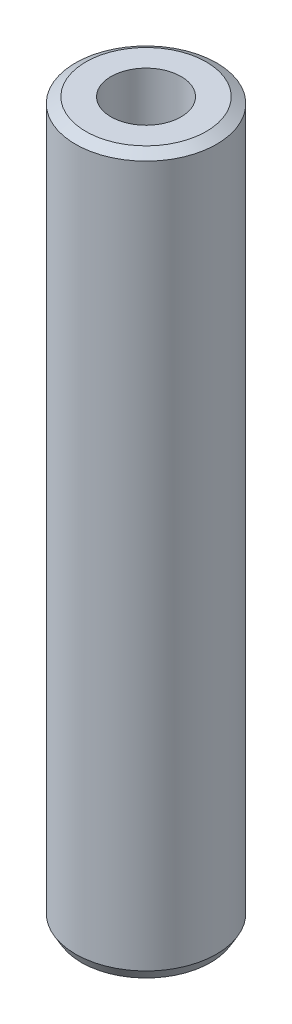
ISO-10303-21;
HEADER;
FILE_DESCRIPTION(('STEP AP214'),'2;1');
FILE_NAME('part.step','',(''),(''),'','','');
FILE_SCHEMA(('AUTOMOTIVE_DESIGN { 1 0 10303 214 1 1 1 1 }'));
ENDSEC;
DATA;
#1=APPLICATION_CONTEXT('core data for automotive mechanical design processes');
#2=APPLICATION_PROTOCOL_DEFINITION('international standard','automotive_design',2000,#1);
#3=PRODUCT_CONTEXT('',#1,'mechanical');
#4=PRODUCT('Part','Part','',(#3));
#5=PRODUCT_RELATED_PRODUCT_CATEGORY('part','',(#4));
#6=PRODUCT_DEFINITION_FORMATION('','',#4);
#7=PRODUCT_DEFINITION_CONTEXT('part definition',#1,'design');
#8=PRODUCT_DEFINITION('design','',#6,#7);
#9=PRODUCT_DEFINITION_SHAPE('','',#8);
#10=(LENGTH_UNIT() NAMED_UNIT(*) SI_UNIT(.MILLI.,.METRE.));
#11=(NAMED_UNIT(*) PLANE_ANGLE_UNIT() SI_UNIT($,.RADIAN.));
#12=(NAMED_UNIT(*) SI_UNIT($,.STERADIAN.) SOLID_ANGLE_UNIT());
#13=UNCERTAINTY_MEASURE_WITH_UNIT(LENGTH_MEASURE(1.E-05),#10,'distance_accuracy_value','');
#14=(GEOMETRIC_REPRESENTATION_CONTEXT(3) GLOBAL_UNCERTAINTY_ASSIGNED_CONTEXT((#13)) GLOBAL_UNIT_ASSIGNED_CONTEXT((#10,
#11,#12)) REPRESENTATION_CONTEXT('',''));
#15=CARTESIAN_POINT('',(0.,0.,0.));
#16=DIRECTION('',(0.,0.,1.));
#17=DIRECTION('',(1.,0.,0.));
#18=AXIS2_PLACEMENT_3D('',#15,#16,#17);
#19=CARTESIAN_POINT('',(0.,355.89672085268,0.));
#20=DIRECTION('',(0.,-1.,0.));
#21=DIRECTION('',(0.,0.,-1.));
#22=AXIS2_PLACEMENT_3D('',#19,#20,#21);
#23=CYLINDRICAL_SURFACE('',#22,35.);
#24=CARTESIAN_POINT('',(0.,352.944748443648,0.));
#25=DIRECTION('',(0.,1.,0.));
#26=DIRECTION('',(0.,0.,1.));
#27=AXIS2_PLACEMENT_3D('',#24,#25,#26);
#28=CIRCLE('',#27,35.);
#29=CARTESIAN_POINT('',(0.,352.944748443648,-35.));
#30=VERTEX_POINT('',#29);
#31=EDGE_CURVE('E50',#30,#30,#28,.F.);
#32=CARTESIAN_POINT('',(0.,5.11296619498541,0.));
#33=DIRECTION('',(0.,1.,0.));
#34=DIRECTION('',(0.,0.,1.));
#35=AXIS2_PLACEMENT_3D('',#32,#33,#34);
#36=CIRCLE('',#35,35.);
#37=CARTESIAN_POINT('',(0.,5.11296619498541,-35.));
#38=VERTEX_POINT('',#37);
#39=EDGE_CURVE('E51',#38,#38,#36,.T.);
#40=CARTESIAN_POINT('',(0.,352.944748443648,-35.));
#41=CARTESIAN_POINT('',(0.,349.321500711891,-35.));
#42=CARTESIAN_POINT('',(0.,345.698252980135,-35.));
#43=CARTESIAN_POINT('',(0.,338.451757516621,-35.));
#44=CARTESIAN_POINT('',(0.,334.828509784864,-35.));
#45=CARTESIAN_POINT('',(0.,327.58201432135,-35.));
#46=CARTESIAN_POINT('',(0.,323.958766589593,-35.));
#47=CARTESIAN_POINT('',(0.,316.712271126079,-35.));
#48=CARTESIAN_POINT('',(0.,313.089023394322,-35.));
#49=CARTESIAN_POINT('',(0.,305.842527930809,-35.));
#50=CARTESIAN_POINT('',(0.,302.219280199052,-35.));
#51=CARTESIAN_POINT('',(0.,294.972784735538,-35.));
#52=CARTESIAN_POINT('',(0.,291.349537003781,-35.));
#53=CARTESIAN_POINT('',(0.,284.103041540267,-35.));
#54=CARTESIAN_POINT('',(0.,280.47979380851,-35.));
#55=CARTESIAN_POINT('',(0.,273.233298344997,-35.));
#56=CARTESIAN_POINT('',(0.,269.61005061324,-35.));
#57=CARTESIAN_POINT('',(0.,262.363555149726,-35.));
#58=CARTESIAN_POINT('',(0.,258.740307417969,-35.));
#59=CARTESIAN_POINT('',(0.,251.493811954455,-35.));
#60=CARTESIAN_POINT('',(0.,247.870564222698,-35.));
#61=CARTESIAN_POINT('',(0.,240.624068759184,-35.));
#62=CARTESIAN_POINT('',(0.,237.000821027427,-35.));
#63=CARTESIAN_POINT('',(0.,229.754325563914,-35.));
#64=CARTESIAN_POINT('',(0.,226.131077832157,-35.));
#65=CARTESIAN_POINT('',(0.,218.884582368643,-35.));
#66=CARTESIAN_POINT('',(0.,215.261334636886,-35.));
#67=CARTESIAN_POINT('',(0.,208.014839173372,-35.));
#68=CARTESIAN_POINT('',(0.,204.391591441615,-35.));
#69=CARTESIAN_POINT('',(0.,197.145095978101,-35.));
#70=CARTESIAN_POINT('',(0.,193.521848246345,-35.));
#71=CARTESIAN_POINT('',(0.,186.275352782831,-35.));
#72=CARTESIAN_POINT('',(0.,182.652105051074,-35.));
#73=CARTESIAN_POINT('',(0.,175.40560958756,-35.));
#74=CARTESIAN_POINT('',(0.,171.782361855803,-35.));
#75=CARTESIAN_POINT('',(0.,164.535866392289,-35.));
#76=CARTESIAN_POINT('',(0.,160.912618660532,-35.));
#77=CARTESIAN_POINT('',(0.,153.666123197019,-35.));
#78=CARTESIAN_POINT('',(0.,150.042875465262,-35.));
#79=CARTESIAN_POINT('',(0.,142.796380001748,-35.));
#80=CARTESIAN_POINT('',(0.,139.173132269991,-35.));
#81=CARTESIAN_POINT('',(0.,131.926636806477,-35.));
#82=CARTESIAN_POINT('',(0.,128.30338907472,-35.));
#83=CARTESIAN_POINT('',(0.,121.056893611206,-35.));
#84=CARTESIAN_POINT('',(0.,117.43364587945,-35.));
#85=CARTESIAN_POINT('',(0.,110.187150415936,-35.));
#86=CARTESIAN_POINT('',(0.,106.563902684179,-35.));
#87=CARTESIAN_POINT('',(0.,99.317407220665,-35.));
#88=CARTESIAN_POINT('',(0.,95.6941594889081,-35.));
#89=CARTESIAN_POINT('',(0.,88.4476640253942,-35.));
#90=CARTESIAN_POINT('',(0.,84.8244162936373,-35.));
#91=CARTESIAN_POINT('',(0.,77.5779208301235,-35.));
#92=CARTESIAN_POINT('',(0.,73.9546730983666,-35.));
#93=CARTESIAN_POINT('',(0.,66.7081776348528,-35.));
#94=CARTESIAN_POINT('',(0.,63.0849299030959,-35.));
#95=CARTESIAN_POINT('',(0.,55.8384344395821,-35.));
#96=CARTESIAN_POINT('',(0.,52.2151867078252,-35.));
#97=CARTESIAN_POINT('',(0.,44.9686912443114,-35.));
#98=CARTESIAN_POINT('',(0.,41.3454435125545,-35.));
#99=CARTESIAN_POINT('',(0.,34.0989480490407,-35.));
#100=CARTESIAN_POINT('',(0.,30.4757003172838,-35.));
#101=CARTESIAN_POINT('',(0.,23.22920485377,-35.));
#102=CARTESIAN_POINT('',(0.,19.6059571220131,-35.));
#103=CARTESIAN_POINT('',(0.,12.3594616584992,-35.));
#104=CARTESIAN_POINT('',(0.,8.73621392674232,-35.));
#105=CARTESIAN_POINT('',(0.,5.11296619498541,-35.));
#106=B_SPLINE_CURVE_WITH_KNOTS('',3,(#40,#41,#42,#43,#44,#45,#46,#47,#48,#49,#50,#51,#52,#53,
#54,#55,#56,#57,#58,#59,#60,#61,#62,#63,#64,#65,#66,#67,#68,#69,#70,#71,#72,#73,#74,#75,#76,#77,
#78,#79,#80,#81,#82,#83,#84,#85,#86,#87,#88,#89,#90,#91,#92,#93,#94,#95,#96,#97,#98,#99,#100,
#101,#102,#103,#104,#105),.UNSPECIFIED.,.F.,.F.,(4,2,2,2,2,2,2,2,2,2,2,2,2,2,2,2,2,2,2,2,2,2,2,
2,2,2,2,2,2,2,2,2,4),(0.,10.8697431952707,21.7394863905414,32.6092295858121,43.4789727810829,
54.3487159763535,65.2184591716243,76.088202366895,86.9579455621657,97.8276887574364,
108.697431952707,119.567175147978,130.436918343249,141.306661538519,152.17640473379,
163.046147929061,173.915891124331,184.785634319602,195.655377514873,206.525120710144,
217.394863905414,228.264607100685,239.134350295956,250.004093491226,260.873836686497,
271.743579881768,282.613323077039,293.483066272309,304.35280946758,315.222552662851,
326.092295858121,336.962039053392,347.831782248663),.UNSPECIFIED.);
#107=EDGE_CURVE('BSEAM39',#30,#38,#106,.T.);
#108=ORIENTED_EDGE('',*,*,#31,.T.);
#109=ORIENTED_EDGE('',*,*,#39,.T.);
#110=ORIENTED_EDGE('',*,*,#107,.T.);
#111=ORIENTED_EDGE('',*,*,#107,.F.);
#112=EDGE_LOOP('',(#108,#110,#109,#111));
#113=FACE_BOUND('',#112,.T.);
#114=ADVANCED_FACE('F39',(#113),#23,.T.);
#115=CARTESIAN_POINT('',(0.,355.89672085268,0.));
#116=DIRECTION('',(0.,1.,0.));
#117=DIRECTION('',(0.,0.,1.));
#118=AXIS2_PLACEMENT_3D('',#115,#116,#117);
#119=PLANE('',#118);
#120=CARTESIAN_POINT('',(0.,355.89672085268,0.));
#121=DIRECTION('',(0.,1.,0.));
#122=DIRECTION('',(0.,0.,1.));
#123=AXIS2_PLACEMENT_3D('',#120,#121,#122);
#124=CIRCLE('',#123,29.8870338050153);
#125=CARTESIAN_POINT('',(0.,355.89672085268,-29.8870338050153));
#126=VERTEX_POINT('',#125);
#127=EDGE_CURVE('E54',#126,#126,#124,.T.);
#128=ORIENTED_EDGE('',*,*,#127,.T.);
#129=EDGE_LOOP('',(#128));
#130=FACE_BOUND('',#129,.T.);
#131=CARTESIAN_POINT('',(0.,355.89672085268,0.));
#132=DIRECTION('',(0.,1.,0.));
#133=DIRECTION('',(0.,0.,1.));
#134=AXIS2_PLACEMENT_3D('',#131,#132,#133);
#135=CIRCLE('',#134,17.3707291224868);
#136=CARTESIAN_POINT('',(0.,355.89672085268,-17.3707291224868));
#137=VERTEX_POINT('',#136);
#138=EDGE_CURVE('E58',#137,#137,#135,.T.);
#139=ORIENTED_EDGE('',*,*,#138,.F.);
#140=EDGE_LOOP('',(#139));
#141=FACE_BOUND('',#140,.T.);
#142=ADVANCED_FACE('F69',(#130,#141),#119,.T.);
#143=CARTESIAN_POINT('',(0.,0.,0.));
#144=DIRECTION('',(0.,1.,0.));
#145=DIRECTION('',(0.,0.,1.));
#146=AXIS2_PLACEMENT_3D('',#143,#144,#145);
#147=PLANE('',#146);
#148=CARTESIAN_POINT('',(0.,0.,0.));
#149=DIRECTION('',(0.,1.,0.));
#150=DIRECTION('',(0.,0.,1.));
#151=AXIS2_PLACEMENT_3D('',#148,#149,#150);
#152=CIRCLE('',#151,32.0480275909677);
#153=CARTESIAN_POINT('',(0.,0.,32.0480275909677));
#154=VERTEX_POINT('',#153);
#155=EDGE_CURVE('E10',#154,#154,#152,.F.);
#156=ORIENTED_EDGE('',*,*,#155,.T.);
#157=EDGE_LOOP('',(#156));
#158=FACE_BOUND('',#157,.T.);
#159=CARTESIAN_POINT('',(0.,0.,0.));
#160=DIRECTION('',(0.,1.,0.));
#161=DIRECTION('',(0.,0.,1.));
#162=AXIS2_PLACEMENT_3D('',#159,#160,#161);
#163=CIRCLE('',#162,17.3707291224868);
#164=CARTESIAN_POINT('',(0.,0.,-17.3707291224868));
#165=VERTEX_POINT('',#164);
#166=EDGE_CURVE('E63',#165,#165,#163,.T.);
#167=ORIENTED_EDGE('',*,*,#166,.T.);
#168=EDGE_LOOP('',(#167));
#169=FACE_BOUND('',#168,.T.);
#170=ADVANCED_FACE('F75',(#158,#169),#147,.F.);
#171=CARTESIAN_POINT('',(0.,355.89672085268,0.));
#172=DIRECTION('',(0.,-1.,0.));
#173=DIRECTION('',(0.,0.,-1.));
#174=AXIS2_PLACEMENT_3D('',#171,#172,#173);
#175=CYLINDRICAL_SURFACE('',#174,17.3707291224868);
#176=CARTESIAN_POINT('',(0.,355.89672085268,-17.3707291224868));
#177=CARTESIAN_POINT('',(0.,352.189463343798,-17.3707291224868));
#178=CARTESIAN_POINT('',(0.,348.482205834916,-17.3707291224868));
#179=CARTESIAN_POINT('',(0.,341.067690817152,-17.3707291224868));
#180=CARTESIAN_POINT('',(0.,337.36043330827,-17.3707291224868));
#181=CARTESIAN_POINT('',(0.,329.945918290506,-17.3707291224868));
#182=CARTESIAN_POINT('',(0.,326.238660781624,-17.3707291224868));
#183=CARTESIAN_POINT('',(0.,318.824145763859,-17.3707291224868));
#184=CARTESIAN_POINT('',(0.,315.116888254977,-17.3707291224868));
#185=CARTESIAN_POINT('',(0.,307.702373237213,-17.3707291224868));
#186=CARTESIAN_POINT('',(0.,303.995115728331,-17.3707291224868));
#187=CARTESIAN_POINT('',(0.,296.580600710567,-17.3707291224868));
#188=CARTESIAN_POINT('',(0.,292.873343201685,-17.3707291224868));
#189=CARTESIAN_POINT('',(0.,285.458828183921,-17.3707291224868));
#190=CARTESIAN_POINT('',(0.,281.751570675039,-17.3707291224868));
#191=CARTESIAN_POINT('',(0.,274.337055657274,-17.3707291224868));
#192=CARTESIAN_POINT('',(0.,270.629798148392,-17.3707291224868));
#193=CARTESIAN_POINT('',(0.,263.215283130628,-17.3707291224868));
#194=CARTESIAN_POINT('',(0.,259.508025621746,-17.3707291224868));
#195=CARTESIAN_POINT('',(0.,252.093510603982,-17.3707291224868));
#196=CARTESIAN_POINT('',(0.,248.3862530951,-17.3707291224868));
#197=CARTESIAN_POINT('',(0.,240.971738077336,-17.3707291224868));
#198=CARTESIAN_POINT('',(0.,237.264480568453,-17.3707291224868));
#199=CARTESIAN_POINT('',(0.,229.849965550689,-17.3707291224868));
#200=CARTESIAN_POINT('',(0.,226.142708041807,-17.3707291224868));
#201=CARTESIAN_POINT('',(0.,218.728193024043,-17.3707291224868));
#202=CARTESIAN_POINT('',(0.,215.020935515161,-17.3707291224868));
#203=CARTESIAN_POINT('',(0.,207.606420497397,-17.3707291224868));
#204=CARTESIAN_POINT('',(0.,203.899162988515,-17.3707291224868));
#205=CARTESIAN_POINT('',(0.,196.484647970751,-17.3707291224868));
#206=CARTESIAN_POINT('',(0.,192.777390461868,-17.3707291224868));
#207=CARTESIAN_POINT('',(0.,185.362875444104,-17.3707291224868));
#208=CARTESIAN_POINT('',(0.,181.655617935222,-17.3707291224868));
#209=CARTESIAN_POINT('',(0.,174.241102917458,-17.3707291224868));
#210=CARTESIAN_POINT('',(0.,170.533845408576,-17.3707291224868));
#211=CARTESIAN_POINT('',(0.,163.119330390812,-17.3707291224868));
#212=CARTESIAN_POINT('',(0.,159.41207288193,-17.3707291224868));
#213=CARTESIAN_POINT('',(0.,151.997557864165,-17.3707291224868));
#214=CARTESIAN_POINT('',(0.,148.290300355283,-17.3707291224868));
#215=CARTESIAN_POINT('',(0.,140.875785337519,-17.3707291224868));
#216=CARTESIAN_POINT('',(0.,137.168527828637,-17.3707291224868));
#217=CARTESIAN_POINT('',(0.,129.754012810873,-17.3707291224868));
#218=CARTESIAN_POINT('',(0.,126.046755301991,-17.3707291224868));
#219=CARTESIAN_POINT('',(0.,118.632240284227,-17.3707291224868));
#220=CARTESIAN_POINT('',(0.,114.924982775345,-17.3707291224868));
#221=CARTESIAN_POINT('',(0.,107.51046775758,-17.3707291224868));
#222=CARTESIAN_POINT('',(0.,103.803210248698,-17.3707291224868));
#223=CARTESIAN_POINT('',(0.,96.3886952309342,-17.3707291224868));
#224=CARTESIAN_POINT('',(0.,92.6814377220521,-17.3707291224868));
#225=CARTESIAN_POINT('',(0.,85.266922704288,-17.3707291224868));
#226=CARTESIAN_POINT('',(0.,81.5596651954059,-17.3707291224868));
#227=CARTESIAN_POINT('',(0.,74.1451501776417,-17.3707291224868));
#228=CARTESIAN_POINT('',(0.,70.4378926687596,-17.3707291224868));
#229=CARTESIAN_POINT('',(0.,63.0233776509955,-17.3707291224868));
#230=CARTESIAN_POINT('',(0.,59.3161201421134,-17.3707291224868));
#231=CARTESIAN_POINT('',(0.,51.9016051243492,-17.3707291224868));
#232=CARTESIAN_POINT('',(0.,48.1943476154671,-17.3707291224868));
#233=CARTESIAN_POINT('',(0.,40.7798325977029,-17.3707291224868));
#234=CARTESIAN_POINT('',(0.,37.0725750888208,-17.3707291224868));
#235=CARTESIAN_POINT('',(0.,29.6580600710566,-17.3707291224868));
#236=CARTESIAN_POINT('',(0.,25.9508025621745,-17.3707291224868));
#237=CARTESIAN_POINT('',(0.,18.5362875444104,-17.3707291224868));
#238=CARTESIAN_POINT('',(0.,14.8290300355283,-17.3707291224868));
#239=CARTESIAN_POINT('',(0.,7.41451501776412,-17.3707291224868));
#240=CARTESIAN_POINT('',(0.,3.70725750888203,-17.3707291224868));
#241=CARTESIAN_POINT('',(0.,0.,-17.3707291224868));
#242=B_SPLINE_CURVE_WITH_KNOTS('',3,(#176,#177,#178,#179,#180,#181,#182,#183,#184,#185,#186,
#187,#188,#189,#190,#191,#192,#193,#194,#195,#196,#197,#198,#199,#200,#201,#202,#203,#204,#205,
#206,#207,#208,#209,#210,#211,#212,#213,#214,#215,#216,#217,#218,#219,#220,#221,#222,#223,#224,
#225,#226,#227,#228,#229,#230,#231,#232,#233,#234,#235,#236,#237,#238,#239,#240,#241),
.UNSPECIFIED.,.F.,.F.,(4,2,2,2,2,2,2,2,2,2,2,2,2,2,2,2,2,2,2,2,2,2,2,2,2,2,2,2,2,2,2,2,4),(0.,
11.1217725266463,22.2435450532926,33.3653175799388,44.4870901065851,55.6088626332313,
66.7306351598776,77.8524076865238,88.9741802131701,100.095952739816,111.217725266463,
122.339497793109,133.461270319755,144.583042846401,155.704815373048,166.826587899694,
177.94836042634,189.070132952986,200.191905479633,211.313678006279,222.435450532925,
233.557223059572,244.678995586218,255.800768112864,266.92254063951,278.044313166157,
289.166085692803,300.287858219449,311.409630746095,322.531403272742,333.653175799388,
344.774948326034,355.89672085268),.UNSPECIFIED.);
#243=EDGE_CURVE('BSEAM70',#137,#165,#242,.T.);
#244=ORIENTED_EDGE('',*,*,#138,.T.);
#245=ORIENTED_EDGE('',*,*,#166,.F.);
#246=ORIENTED_EDGE('',*,*,#243,.T.);
#247=ORIENTED_EDGE('',*,*,#243,.F.);
#248=EDGE_LOOP('',(#244,#246,#245,#247));
#249=FACE_BOUND('',#248,.T.);
#250=ADVANCED_FACE('F70',(#249),#175,.F.);
#251=CARTESIAN_POINT('',(0.,355.89672085268,0.));
#252=DIRECTION('',(0.,-1.,0.));
#253=DIRECTION('',(0.,0.,-1.));
#254=AXIS2_PLACEMENT_3D('',#251,#252,#253);
#255=CONICAL_SURFACE('',#254,29.8870338050153,1.0471975511966);
#256=CARTESIAN_POINT('',(0.,352.944748443648,-35.0000000000001));
#257=CARTESIAN_POINT('',(0.,352.975498156242,-34.946739935469));
#258=CARTESIAN_POINT('',(0.,353.006247868837,-34.8934798709379));
#259=CARTESIAN_POINT('',(0.,353.067747294025,-34.7869597418757));
#260=CARTESIAN_POINT('',(0.,353.098497006619,-34.7336996773446));
#261=CARTESIAN_POINT('',(0.,353.159996431807,-34.6271795482824));
#262=CARTESIAN_POINT('',(0.,353.190746144401,-34.5739194837513));
#263=CARTESIAN_POINT('',(0.,353.252245569589,-34.4673993546892));
#264=CARTESIAN_POINT('',(0.,353.282995282183,-34.4141392901581));
#265=CARTESIAN_POINT('',(0.,353.344494707371,-34.3076191610959));
#266=CARTESIAN_POINT('',(0.,353.375244419966,-34.2543590965648));
#267=CARTESIAN_POINT('',(0.,353.436743845154,-34.1478389675026));
#268=CARTESIAN_POINT('',(0.,353.467493557748,-34.0945789029715));
#269=CARTESIAN_POINT('',(0.,353.528992982936,-33.9880587739093));
#270=CARTESIAN_POINT('',(0.,353.55974269553,-33.9347987093782));
#271=CARTESIAN_POINT('',(0.,353.621242120718,-33.8282785803161));
#272=CARTESIAN_POINT('',(0.,353.651991833312,-33.775018515785));
#273=CARTESIAN_POINT('',(0.,353.7134912585,-33.6684983867228));
#274=CARTESIAN_POINT('',(0.,353.744240971095,-33.6152383221917));
#275=CARTESIAN_POINT('',(0.,353.805740396283,-33.5087181931295));
#276=CARTESIAN_POINT('',(0.,353.836490108877,-33.4554581285984));
#277=CARTESIAN_POINT('',(0.,353.897989534065,-33.3489379995362));
#278=CARTESIAN_POINT('',(0.,353.928739246659,-33.2956779350052));
#279=CARTESIAN_POINT('',(0.,353.990238671847,-33.189157805943));
#280=CARTESIAN_POINT('',(0.,354.020988384441,-33.1358977414119));
#281=CARTESIAN_POINT('',(0.,354.082487809629,-33.0293776123497));
#282=CARTESIAN_POINT('',(0.,354.113237522224,-32.9761175478186));
#283=CARTESIAN_POINT('',(0.,354.174736947412,-32.8695974187564));
#284=CARTESIAN_POINT('',(0.,354.205486660006,-32.8163373542253));
#285=CARTESIAN_POINT('',(0.,354.266986085194,-32.7098172251631));
#286=CARTESIAN_POINT('',(0.,354.297735797788,-32.6565571606321));
#287=CARTESIAN_POINT('',(0.,354.359235222976,-32.5500370315699));
#288=CARTESIAN_POINT('',(0.,354.38998493557,-32.4967769670388));
#289=CARTESIAN_POINT('',(0.,354.451484360758,-32.3902568379766));
#290=CARTESIAN_POINT('',(0.,354.482234073353,-32.3369967734455));
#291=CARTESIAN_POINT('',(0.,354.543733498541,-32.2304766443833));
#292=CARTESIAN_POINT('',(0.,354.574483211135,-32.1772165798522));
#293=CARTESIAN_POINT('',(0.,354.635982636323,-32.0706964507901));
#294=CARTESIAN_POINT('',(0.,354.666732348917,-32.017436386259));
#295=CARTESIAN_POINT('',(0.,354.728231774105,-31.9109162571968));
#296=CARTESIAN_POINT('',(0.,354.758981486699,-31.8576561926657));
#297=CARTESIAN_POINT('',(0.,354.820480911887,-31.7511360636035));
#298=CARTESIAN_POINT('',(0.,354.851230624482,-31.6978759990724));
#299=CARTESIAN_POINT('',(0.,354.91273004967,-31.5913558700102));
#300=CARTESIAN_POINT('',(0.,354.943479762264,-31.5380958054791));
#301=CARTESIAN_POINT('',(0.,355.004979187452,-31.431575676417));
#302=CARTESIAN_POINT('',(0.,355.035728900046,-31.3783156118859));
#303=CARTESIAN_POINT('',(0.,355.097228325234,-31.2717954828237));
#304=CARTESIAN_POINT('',(0.,355.127978037828,-31.2185354182926));
#305=CARTESIAN_POINT('',(0.,355.189477463016,-31.1120152892304));
#306=CARTESIAN_POINT('',(0.,355.22022717561,-31.0587552246993));
#307=CARTESIAN_POINT('',(0.,355.281726600799,-30.9522350956371));
#308=CARTESIAN_POINT('',(0.,355.312476313393,-30.8989750311061));
#309=CARTESIAN_POINT('',(0.,355.373975738581,-30.7924549020439));
#310=CARTESIAN_POINT('',(0.,355.404725451175,-30.7391948375128));
#311=CARTESIAN_POINT('',(0.,355.466224876363,-30.6326747084506));
#312=CARTESIAN_POINT('',(0.,355.496974588957,-30.5794146439195));
#313=CARTESIAN_POINT('',(0.,355.558474014145,-30.4728945148573));
#314=CARTESIAN_POINT('',(0.,355.589223726739,-30.4196344503262));
#315=CARTESIAN_POINT('',(0.,355.650723151928,-30.313114321264));
#316=CARTESIAN_POINT('',(0.,355.681472864522,-30.259854256733));
#317=CARTESIAN_POINT('',(0.,355.74297228971,-30.1533341276708));
#318=CARTESIAN_POINT('',(0.,355.773722002304,-30.1000740631397));
#319=CARTESIAN_POINT('',(0.,355.835221427492,-29.9935539340775));
#320=CARTESIAN_POINT('',(0.,355.865971140086,-29.9402938695464));
#321=CARTESIAN_POINT('',(0.,355.89672085268,-29.8870338050153));
#322=B_SPLINE_CURVE_WITH_KNOTS('',3,(#256,#257,#258,#259,#260,#261,#262,#263,#264,#265,#266,
#267,#268,#269,#270,#271,#272,#273,#274,#275,#276,#277,#278,#279,#280,#281,#282,#283,#284,#285,
#286,#287,#288,#289,#290,#291,#292,#293,#294,#295,#296,#297,#298,#299,#300,#301,#302,#303,#304,
#305,#306,#307,#308,#309,#310,#311,#312,#313,#314,#315,#316,#317,#318,#319,#320,#321),
.UNSPECIFIED.,.F.,.F.,(4,2,2,2,2,2,2,2,2,2,2,2,2,2,2,2,2,2,2,2,2,2,2,2,2,2,2,2,2,2,2,2,4),(0.,
0.184498275564506,0.368996551128984,0.55349482669349,0.737993102257974,0.92249137782248,
1.10698965338696,1.29148792895146,1.47598620451594,1.66048448008045,1.84498275564493,
2.02948103120944,2.21397930677392,2.39847758233842,2.58297585790291,2.76747413346741,
2.95197240903189,3.1364706845964,3.32096896016088,3.50546723572538,3.68996551128987,
3.87446378685437,4.05896206241885,4.24346033798336,4.42795861354787,4.61245688911235,
4.79695516467685,4.98145344024133,5.16595171580584,5.35044999137032,5.53494826693482,
5.7194465424993,5.90394481806381),.UNSPECIFIED.);
#323=EDGE_CURVE('BSEAM81',#30,#126,#322,.T.);
#324=ORIENTED_EDGE('',*,*,#31,.F.);
#325=ORIENTED_EDGE('',*,*,#127,.F.);
#326=ORIENTED_EDGE('',*,*,#323,.T.);
#327=ORIENTED_EDGE('',*,*,#323,.F.);
#328=EDGE_LOOP('',(#324,#326,#325,#327));
#329=FACE_BOUND('',#328,.T.);
#330=ADVANCED_FACE('F81',(#329),#255,.T.);
#331=CARTESIAN_POINT('',(0.,5.11296619498541,0.));
#332=DIRECTION('',(0.,1.,0.));
#333=DIRECTION('',(0.,0.,1.));
#334=AXIS2_PLACEMENT_3D('',#331,#332,#333);
#335=CONICAL_SURFACE('',#334,35.,0.523598775598308);
#336=ORIENTED_EDGE('',*,*,#155,.F.);
#337=EDGE_LOOP('',(#336));
#338=FACE_BOUND('',#337,.T.);
#339=ORIENTED_EDGE('',*,*,#39,.F.);
#340=EDGE_LOOP('',(#339));
#341=FACE_BOUND('',#340,.T.);
#342=ADVANCED_FACE('F45',(#338,#341),#335,.T.);
#343=CLOSED_SHELL('',(#114,#142,#170,#250,#330,#342));
#344=MANIFOLD_SOLID_BREP('B2',#343);
#345=ADVANCED_BREP_SHAPE_REPRESENTATION('',(#18,#344),#14);
#346=SHAPE_DEFINITION_REPRESENTATION(#9,#345);
ENDSEC;
END-ISO-10303-21;
